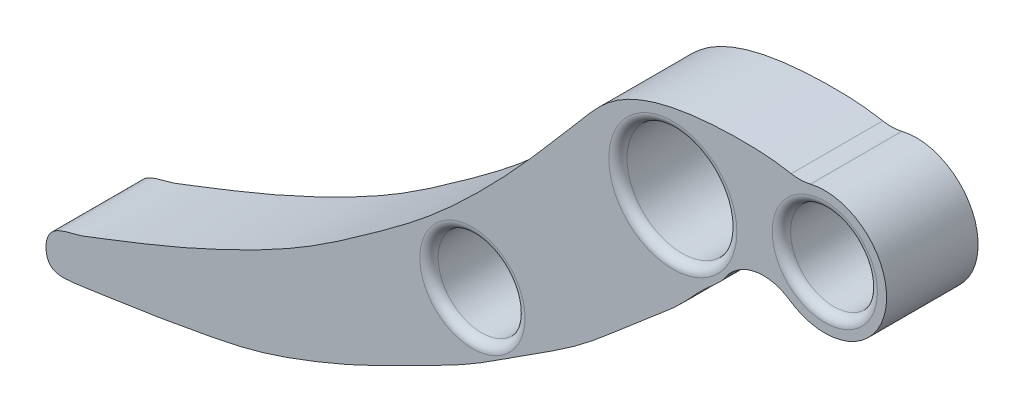
ISO-10303-21;
HEADER;
FILE_DESCRIPTION(('STEP AP214'),'2;1');
FILE_NAME('part.step','',(''),(''),'','','');
FILE_SCHEMA(('AUTOMOTIVE_DESIGN { 1 0 10303 214 1 1 1 1 }'));
ENDSEC;
DATA;
#1=APPLICATION_CONTEXT('core data for automotive mechanical design processes');
#2=APPLICATION_PROTOCOL_DEFINITION('international standard','automotive_design',2000,#1);
#3=PRODUCT_CONTEXT('',#1,'mechanical');
#4=PRODUCT('Part','Part','',(#3));
#5=PRODUCT_RELATED_PRODUCT_CATEGORY('part','',(#4));
#6=PRODUCT_DEFINITION_FORMATION('','',#4);
#7=PRODUCT_DEFINITION_CONTEXT('part definition',#1,'design');
#8=PRODUCT_DEFINITION('design','',#6,#7);
#9=PRODUCT_DEFINITION_SHAPE('','',#8);
#10=(LENGTH_UNIT() NAMED_UNIT(*) SI_UNIT(.MILLI.,.METRE.));
#11=(NAMED_UNIT(*) PLANE_ANGLE_UNIT() SI_UNIT($,.RADIAN.));
#12=(NAMED_UNIT(*) SI_UNIT($,.STERADIAN.) SOLID_ANGLE_UNIT());
#13=UNCERTAINTY_MEASURE_WITH_UNIT(LENGTH_MEASURE(1.E-05),#10,'distance_accuracy_value','');
#14=(GEOMETRIC_REPRESENTATION_CONTEXT(3) GLOBAL_UNCERTAINTY_ASSIGNED_CONTEXT((#13)) GLOBAL_UNIT_ASSIGNED_CONTEXT((#10,
#11,#12)) REPRESENTATION_CONTEXT('',''));
#15=CARTESIAN_POINT('',(0.,0.,0.));
#16=DIRECTION('',(0.,0.,1.));
#17=DIRECTION('',(1.,0.,0.));
#18=AXIS2_PLACEMENT_3D('',#15,#16,#17);
#19=CARTESIAN_POINT('',(14.8906172336241,5.13952335697984,4.));
#20=CARTESIAN_POINT('',(11.8147997997312,6.98265296999133,4.));
#21=CARTESIAN_POINT('',(6.97061773138313,7.34913695348203,4.));
#22=CARTESIAN_POINT('',(0.0255067181909356,6.82829789173735,4.));
#23=CARTESIAN_POINT('',(-4.91113051022182,5.37360829612983,4.));
#24=CARTESIAN_POINT('',(-8.00179722143057,1.72142887729755,4.));
#25=CARTESIAN_POINT('',(-10.6771431186925,-1.44866581411064,4.));
#26=CARTESIAN_POINT('',(-13.6194497429282,-4.80712519572691,4.));
#27=CARTESIAN_POINT('',(-17.4437385651632,-8.79751193254247,4.));
#28=CARTESIAN_POINT('',(-21.5414716082317,-12.5724179526008,4.));
#29=CARTESIAN_POINT('',(-26.6115682871123,-16.2824321569651,4.));
#30=CARTESIAN_POINT('',(-31.7679818192911,-19.9143573813329,4.));
#31=CARTESIAN_POINT('',(-37.8743258746726,-23.1648730949254,4.));
#32=CARTESIAN_POINT('',(-44.290018540295,-26.081814499858,4.));
#33=CARTESIAN_POINT('',(-48.7035337551994,-27.7570490931934,4.));
#34=CARTESIAN_POINT('',(-52.4560401220076,-29.2525018396844,4.));
#35=CARTESIAN_POINT('',(-54.8950665794195,-29.458745870946,4.));
#36=CARTESIAN_POINT('',(-54.8752929321307,-33.1891540703935,4.));
#37=CARTESIAN_POINT('',(-50.8297040981423,-32.605168512718,4.));
#38=CARTESIAN_POINT('',(-45.8082015178911,-31.8917719175334,4.));
#39=CARTESIAN_POINT('',(-41.8530072288273,-31.1890679821412,4.));
#40=CARTESIAN_POINT('',(-36.8359921070759,-30.2305680535858,4.));
#41=CARTESIAN_POINT('',(-32.3334348450041,-28.6931763162461,4.));
#42=CARTESIAN_POINT('',(-27.5209531029798,-26.7119670644439,4.));
#43=CARTESIAN_POINT('',(-22.5920905661132,-24.1756126445635,4.));
#44=CARTESIAN_POINT('',(-17.7022474939589,-21.7780258061123,4.));
#45=CARTESIAN_POINT('',(-12.9767858292529,-18.57152719076,4.));
#46=CARTESIAN_POINT('',(-8.50635045017944,-15.8496570433512,4.));
#47=CARTESIAN_POINT('',(-4.79444683234737,-12.6489598924876,4.));
#48=CARTESIAN_POINT('',(-1.92195812157698,-10.1724124225189,4.));
#49=CARTESIAN_POINT('',(0.774409867975847,-7.95562213565333,4.));
#50=CARTESIAN_POINT('',(2.53720201195287,-5.8137401298697,4.));
#51=CARTESIAN_POINT('',(4.61350821998148,-4.22409829569652,4.));
#52=CARTESIAN_POINT('',(5.39053229105744,-2.38509376200141,4.));
#53=CARTESIAN_POINT('',(7.90182410880479,-0.999504146319266,4.));
#54=CARTESIAN_POINT('',(10.079853046453,-1.20270173484881,4.));
#55=CARTESIAN_POINT('',(11.4905990521554,-1.84225935748622,4.));
#56=B_SPLINE_CURVE_WITH_KNOTS('',3,(#19,#20,#21,#22,#23,#24,#25,#26,#27,#28,#29,#30,#31,#32,#33,
#34,#35,#36,#37,#38,#39,#40,#41,#42,#43,#44,#45,#46,#47,#48,#49,#50,#51,#52,#53,#54,#55),
.UNSPECIFIED.,.F.,.F.,(4,1,1,1,1,1,1,1,1,1,1,1,1,1,1,1,1,1,1,1,1,1,1,1,1,1,1,1,1,1,1,1,1,1,4),
(0.,0.0649005022991945,0.0884003629295933,0.131422169041814,0.155558546016789,0.176507872680281,
0.209387060788076,0.239014532561419,0.280012714709477,0.313443891551223,0.356616380608806,
0.397784948745958,0.443365378941093,0.485923752332835,0.492844268612064,0.512570541733386,
0.525807518463163,0.542884707508247,0.574177107133922,0.610427481034306,0.636920676772048,
0.666470325120271,0.70094601674211,0.734598708994912,0.771031932891885,0.8033765924054,
0.842135532903864,0.869451651947628,0.895551683692015,0.913715434169222,0.93505941780996,
0.947634120889373,0.962394457054,0.970576348482298,1.),.UNSPECIFIED.);
#57=DIRECTION('',(0.,0.,-1.));
#58=VECTOR('',#57,1.);
#59=SURFACE_OF_LINEAR_EXTRUSION('',#56,#58);
#60=CARTESIAN_POINT('',(10.354654534001,6.80738077680452,4.));
#61=VERTEX_POINT('',#60);
#62=CARTESIAN_POINT('',(4.63153611186355,-3.86941888906301,4.));
#63=VERTEX_POINT('',#62);
#64=EDGE_CURVE('E96',#61,#63,#56,.T.);
#65=ORIENTED_EDGE('',*,*,#64,.F.);
#66=DIRECTION('',(0.,0.,-1.));
#67=VECTOR('',#66,1.);
#68=CARTESIAN_POINT('',(10.354654534001,6.80738077680452,4.));
#69=LINE('',#68,#67);
#70=CARTESIAN_POINT('',(10.354654534001,6.80738077680452,-4.));
#71=VERTEX_POINT('',#70);
#72=EDGE_CURVE('E109',#61,#71,#69,.T.);
#73=ORIENTED_EDGE('',*,*,#72,.T.);
#74=CARTESIAN_POINT('',(14.8906172336241,5.13952335697984,-4.));
#75=CARTESIAN_POINT('',(11.8147997997312,6.98265296999133,-4.));
#76=CARTESIAN_POINT('',(6.97061773138313,7.34913695348203,-4.));
#77=CARTESIAN_POINT('',(0.0255067181909356,6.82829789173735,-4.));
#78=CARTESIAN_POINT('',(-4.91113051022182,5.37360829612983,-4.));
#79=CARTESIAN_POINT('',(-8.00179722143057,1.72142887729755,-4.));
#80=CARTESIAN_POINT('',(-10.6771431186925,-1.44866581411064,-4.));
#81=CARTESIAN_POINT('',(-13.6194497429282,-4.80712519572691,-4.));
#82=CARTESIAN_POINT('',(-17.4437385651632,-8.79751193254247,-4.));
#83=CARTESIAN_POINT('',(-21.5414716082317,-12.5724179526008,-4.));
#84=CARTESIAN_POINT('',(-26.6115682871123,-16.2824321569651,-4.));
#85=CARTESIAN_POINT('',(-31.7679818192911,-19.9143573813329,-4.));
#86=CARTESIAN_POINT('',(-37.8743258746726,-23.1648730949254,-4.));
#87=CARTESIAN_POINT('',(-44.290018540295,-26.081814499858,-4.));
#88=CARTESIAN_POINT('',(-48.7035337551994,-27.7570490931934,-4.));
#89=CARTESIAN_POINT('',(-52.4560401220076,-29.2525018396844,-4.));
#90=CARTESIAN_POINT('',(-54.8950665794195,-29.458745870946,-4.));
#91=CARTESIAN_POINT('',(-54.8752929321307,-33.1891540703935,-4.));
#92=CARTESIAN_POINT('',(-50.8297040981423,-32.605168512718,-4.));
#93=CARTESIAN_POINT('',(-45.8082015178911,-31.8917719175334,-4.));
#94=CARTESIAN_POINT('',(-41.8530072288273,-31.1890679821412,-4.));
#95=CARTESIAN_POINT('',(-36.8359921070759,-30.2305680535858,-4.));
#96=CARTESIAN_POINT('',(-32.3334348450041,-28.6931763162461,-4.));
#97=CARTESIAN_POINT('',(-27.5209531029798,-26.7119670644439,-4.));
#98=CARTESIAN_POINT('',(-22.5920905661132,-24.1756126445635,-4.));
#99=CARTESIAN_POINT('',(-17.7022474939589,-21.7780258061123,-4.));
#100=CARTESIAN_POINT('',(-12.9767858292529,-18.57152719076,-4.));
#101=CARTESIAN_POINT('',(-8.50635045017944,-15.8496570433512,-4.));
#102=CARTESIAN_POINT('',(-4.79444683234737,-12.6489598924876,-4.));
#103=CARTESIAN_POINT('',(-1.92195812157698,-10.1724124225189,-4.));
#104=CARTESIAN_POINT('',(0.774409867975847,-7.95562213565333,-4.));
#105=CARTESIAN_POINT('',(2.53720201195287,-5.8137401298697,-4.));
#106=CARTESIAN_POINT('',(4.61350821998148,-4.22409829569652,-4.));
#107=CARTESIAN_POINT('',(5.39053229105744,-2.38509376200141,-4.));
#108=CARTESIAN_POINT('',(7.90182410880479,-0.999504146319266,-4.));
#109=CARTESIAN_POINT('',(10.079853046453,-1.20270173484881,-4.));
#110=CARTESIAN_POINT('',(11.4905990521554,-1.84225935748622,-4.));
#111=B_SPLINE_CURVE_WITH_KNOTS('',3,(#74,#75,#76,#77,#78,#79,#80,#81,#82,#83,#84,#85,#86,#87,
#88,#89,#90,#91,#92,#93,#94,#95,#96,#97,#98,#99,#100,#101,#102,#103,#104,#105,#106,#107,#108,
#109,#110),.UNSPECIFIED.,.F.,.F.,(4,1,1,1,1,1,1,1,1,1,1,1,1,1,1,1,1,1,1,1,1,1,1,1,1,1,1,1,1,1,1,
1,1,1,4),(0.,0.0649005022991945,0.0884003629295933,0.131422169041814,0.155558546016789,
0.176507872680281,0.209387060788076,0.239014532561419,0.280012714709477,0.313443891551223,
0.356616380608806,0.397784948745958,0.443365378941093,0.485923752332835,0.492844268612064,
0.512570541733386,0.525807518463163,0.542884707508247,0.574177107133922,0.610427481034306,
0.636920676772048,0.666470325120271,0.70094601674211,0.734598708994912,0.771031932891885,
0.8033765924054,0.842135532903864,0.869451651947628,0.895551683692015,0.913715434169222,
0.93505941780996,0.947634120889373,0.962394457054,0.970576348482298,1.),.UNSPECIFIED.);
#112=CARTESIAN_POINT('',(4.63153611186355,-3.86941888906301,-4.));
#113=VERTEX_POINT('',#112);
#114=EDGE_CURVE('E97',#71,#113,#111,.T.);
#115=ORIENTED_EDGE('',*,*,#114,.T.);
#116=DIRECTION('',(0.,0.,-1.));
#117=VECTOR('',#116,1.);
#118=CARTESIAN_POINT('',(4.63153611186355,-3.86941888906301,-4.));
#119=LINE('',#118,#117);
#120=EDGE_CURVE('E88',#113,#63,#119,.F.);
#121=ORIENTED_EDGE('',*,*,#120,.T.);
#122=EDGE_LOOP('',(#65,#73,#115,#121));
#123=FACE_BOUND('',#122,.T.);
#124=ADVANCED_FACE('F38',(#123),#59,.F.);
#125=CARTESIAN_POINT('',(13.2914162094649,1.59954005959176,4.));
#126=DIRECTION('',(0.,0.,-1.));
#127=DIRECTION('',(-1.,0.,0.));
#128=AXIS2_PLACEMENT_3D('',#125,#126,#127);
#129=CYLINDRICAL_SURFACE('',#128,5.4);
#130=CARTESIAN_POINT('',(13.2914162094649,1.59954005959176,-4.));
#131=DIRECTION('',(0.,0.,1.));
#132=DIRECTION('',(1.,0.,0.));
#133=AXIS2_PLACEMENT_3D('',#130,#131,#132);
#134=CIRCLE('',#133,5.4);
#135=CARTESIAN_POINT('',(10.2142904399725,-2.83794763038843,-4.));
#136=VERTEX_POINT('',#135);
#137=CARTESIAN_POINT('',(12.0282240750873,6.84971583109186,-4.));
#138=VERTEX_POINT('',#137);
#139=EDGE_CURVE('E92',#136,#138,#134,.T.);
#140=ORIENTED_EDGE('',*,*,#139,.T.);
#141=DIRECTION('',(0.,0.,-1.));
#142=VECTOR('',#141,1.);
#143=CARTESIAN_POINT('',(12.0282240750873,6.84971583109186,4.));
#144=LINE('',#143,#142);
#145=CARTESIAN_POINT('',(12.0282240750873,6.84971583109186,4.));
#146=VERTEX_POINT('',#145);
#147=EDGE_CURVE('E60',#138,#146,#144,.F.);
#148=ORIENTED_EDGE('',*,*,#147,.T.);
#149=CARTESIAN_POINT('',(13.2914162094649,1.59954005959176,4.));
#150=DIRECTION('',(0.,0.,1.));
#151=DIRECTION('',(1.,0.,0.));
#152=AXIS2_PLACEMENT_3D('',#149,#150,#151);
#153=CIRCLE('',#152,5.4);
#154=CARTESIAN_POINT('',(10.2142904399725,-2.83794763038843,4.));
#155=VERTEX_POINT('',#154);
#156=EDGE_CURVE('E93',#155,#146,#153,.T.);
#157=ORIENTED_EDGE('',*,*,#156,.F.);
#158=DIRECTION('',(0.,0.,-1.));
#159=VECTOR('',#158,1.);
#160=CARTESIAN_POINT('',(10.2142904399725,-2.83794763038843,4.));
#161=LINE('',#160,#159);
#162=EDGE_CURVE('E86',#155,#136,#161,.T.);
#163=ORIENTED_EDGE('',*,*,#162,.T.);
#164=EDGE_LOOP('',(#140,#148,#157,#163));
#165=FACE_BOUND('',#164,.T.);
#166=ADVANCED_FACE('F91',(#165),#129,.T.);
#167=CARTESIAN_POINT('',(-17.5147030632143,-15.7755164672443,4.));
#168=DIRECTION('',(0.,0.,-1.));
#169=DIRECTION('',(-1.,0.,0.));
#170=AXIS2_PLACEMENT_3D('',#167,#168,#169);
#171=CYLINDRICAL_SURFACE('',#170,3.8);
#172=CARTESIAN_POINT('',(-17.5147030632143,-15.7755164672443,-3.2));
#173=DIRECTION('',(0.,0.,1.));
#174=DIRECTION('',(1.,0.,0.));
#175=AXIS2_PLACEMENT_3D('',#172,#173,#174);
#176=CIRCLE('',#175,3.8);
#177=CARTESIAN_POINT('',(-13.7147030632143,-15.7755164672443,-3.2));
#178=VERTEX_POINT('',#177);
#179=EDGE_CURVE('E128',#178,#178,#176,.F.);
#180=ORIENTED_EDGE('',*,*,#179,.T.);
#181=EDGE_LOOP('',(#180));
#182=FACE_BOUND('',#181,.T.);
#183=CARTESIAN_POINT('',(-17.5147030632143,-15.7755164672443,3.2));
#184=DIRECTION('',(0.,0.,1.));
#185=DIRECTION('',(1.,0.,0.));
#186=AXIS2_PLACEMENT_3D('',#183,#184,#185);
#187=CIRCLE('',#186,3.8);
#188=CARTESIAN_POINT('',(-13.7147030632143,-15.7755164672443,3.2));
#189=VERTEX_POINT('',#188);
#190=EDGE_CURVE('E125',#189,#189,#187,.T.);
#191=ORIENTED_EDGE('',*,*,#190,.T.);
#192=EDGE_LOOP('',(#191));
#193=FACE_BOUND('',#192,.T.);
#194=ADVANCED_FACE('F165',(#182,#193),#171,.F.);
#195=CARTESIAN_POINT('',(0.,0.,4.));
#196=DIRECTION('',(0.,0.,-1.));
#197=DIRECTION('',(-1.,0.,0.));
#198=AXIS2_PLACEMENT_3D('',#195,#196,#197);
#199=CYLINDRICAL_SURFACE('',#198,4.8);
#200=CARTESIAN_POINT('',(0.,0.,-3.2));
#201=DIRECTION('',(0.,0.,1.));
#202=DIRECTION('',(1.,0.,0.));
#203=AXIS2_PLACEMENT_3D('',#200,#201,#202);
#204=CIRCLE('',#203,4.8);
#205=CARTESIAN_POINT('',(4.8,0.,-3.2));
#206=VERTEX_POINT('',#205);
#207=EDGE_CURVE('E143',#206,#206,#204,.F.);
#208=ORIENTED_EDGE('',*,*,#207,.T.);
#209=EDGE_LOOP('',(#208));
#210=FACE_BOUND('',#209,.T.);
#211=CARTESIAN_POINT('',(0.,0.,3.2));
#212=DIRECTION('',(0.,0.,1.));
#213=DIRECTION('',(1.,0.,0.));
#214=AXIS2_PLACEMENT_3D('',#211,#212,#213);
#215=CIRCLE('',#214,4.8);
#216=CARTESIAN_POINT('',(4.8,0.,3.2));
#217=VERTEX_POINT('',#216);
#218=EDGE_CURVE('E140',#217,#217,#215,.T.);
#219=ORIENTED_EDGE('',*,*,#218,.T.);
#220=EDGE_LOOP('',(#219));
#221=FACE_BOUND('',#220,.T.);
#222=ADVANCED_FACE('F210',(#210,#221),#199,.F.);
#223=CARTESIAN_POINT('',(13.2914162094649,1.59954005959176,4.));
#224=DIRECTION('',(0.,0.,-1.));
#225=DIRECTION('',(-1.,0.,0.));
#226=AXIS2_PLACEMENT_3D('',#223,#224,#225);
#227=CYLINDRICAL_SURFACE('',#226,3.8);
#228=CARTESIAN_POINT('',(13.2914162094649,1.59954005959176,-3.2));
#229=DIRECTION('',(0.,0.,1.));
#230=DIRECTION('',(1.,0.,0.));
#231=AXIS2_PLACEMENT_3D('',#228,#229,#230);
#232=CIRCLE('',#231,3.8);
#233=CARTESIAN_POINT('',(17.0914162094649,1.59954005959176,-3.2));
#234=VERTEX_POINT('',#233);
#235=EDGE_CURVE('E11',#234,#234,#232,.F.);
#236=ORIENTED_EDGE('',*,*,#235,.T.);
#237=EDGE_LOOP('',(#236));
#238=FACE_BOUND('',#237,.T.);
#239=CARTESIAN_POINT('',(13.2914162094649,1.59954005959176,3.2));
#240=DIRECTION('',(0.,0.,1.));
#241=DIRECTION('',(1.,0.,0.));
#242=AXIS2_PLACEMENT_3D('',#239,#240,#241);
#243=CIRCLE('',#242,3.8);
#244=CARTESIAN_POINT('',(17.0914162094649,1.59954005959176,3.2));
#245=VERTEX_POINT('',#244);
#246=EDGE_CURVE('E46',#245,#245,#243,.T.);
#247=ORIENTED_EDGE('',*,*,#246,.T.);
#248=EDGE_LOOP('',(#247));
#249=FACE_BOUND('',#248,.T.);
#250=ADVANCED_FACE('F148',(#238,#249),#227,.F.);
#251=CARTESIAN_POINT('',(0.,0.,4.));
#252=DIRECTION('',(0.,0.,1.));
#253=DIRECTION('',(1.,0.,0.));
#254=AXIS2_PLACEMENT_3D('',#251,#252,#253);
#255=PLANE('',#254);
#256=CARTESIAN_POINT('',(-17.5147030632143,-15.7755164672443,4.));
#257=DIRECTION('',(0.,0.,1.));
#258=DIRECTION('',(1.,0.,0.));
#259=AXIS2_PLACEMENT_3D('',#256,#257,#258);
#260=CIRCLE('',#259,4.6);
#261=CARTESIAN_POINT('',(-12.9147030632143,-15.7755164672443,4.));
#262=VERTEX_POINT('',#261);
#263=EDGE_CURVE('E137',#262,#262,#260,.F.);
#264=ORIENTED_EDGE('',*,*,#263,.T.);
#265=EDGE_LOOP('',(#264));
#266=FACE_BOUND('',#265,.T.);
#267=CARTESIAN_POINT('',(0.,0.,4.));
#268=DIRECTION('',(0.,0.,1.));
#269=DIRECTION('',(1.,0.,0.));
#270=AXIS2_PLACEMENT_3D('',#267,#268,#269);
#271=CIRCLE('',#270,5.6);
#272=CARTESIAN_POINT('',(5.6,0.,4.));
#273=VERTEX_POINT('',#272);
#274=EDGE_CURVE('E134',#273,#273,#271,.F.);
#275=ORIENTED_EDGE('',*,*,#274,.T.);
#276=EDGE_LOOP('',(#275));
#277=FACE_BOUND('',#276,.T.);
#278=CARTESIAN_POINT('',(13.2914162094649,1.59954005959176,4.));
#279=DIRECTION('',(0.,0.,1.));
#280=DIRECTION('',(1.,0.,0.));
#281=AXIS2_PLACEMENT_3D('',#278,#279,#280);
#282=CIRCLE('',#281,4.6);
#283=CARTESIAN_POINT('',(17.8914162094649,1.59954005959176,4.));
#284=VERTEX_POINT('',#283);
#285=EDGE_CURVE('E131',#284,#284,#282,.F.);
#286=ORIENTED_EDGE('',*,*,#285,.T.);
#287=EDGE_LOOP('',(#286));
#288=FACE_BOUND('',#287,.T.);
#289=ORIENTED_EDGE('',*,*,#156,.T.);
#290=CARTESIAN_POINT('',(11.0925261977706,10.7387349210919,4.));
#291=DIRECTION('',(0.,0.,1.));
#292=DIRECTION('',(1.,0.,0.));
#293=AXIS2_PLACEMENT_3D('',#290,#291,#292);
#294=CIRCLE('',#293,4.);
#295=EDGE_CURVE('E114',#146,#61,#294,.F.);
#296=ORIENTED_EDGE('',*,*,#295,.T.);
#297=ORIENTED_EDGE('',*,*,#64,.T.);
#298=CARTESIAN_POINT('',(7.93493801812621,-6.1249755488923,4.));
#299=DIRECTION('',(0.,0.,1.));
#300=DIRECTION('',(1.,0.,0.));
#301=AXIS2_PLACEMENT_3D('',#298,#299,#300);
#302=CIRCLE('',#301,4.);
#303=EDGE_CURVE('E89',#63,#155,#302,.F.);
#304=ORIENTED_EDGE('',*,*,#303,.T.);
#305=EDGE_LOOP('',(#289,#296,#297,#304));
#306=FACE_BOUND('',#305,.T.);
#307=ADVANCED_FACE('F179',(#266,#277,#288,#306),#255,.T.);
#308=CARTESIAN_POINT('',(0.,0.,-4.));
#309=DIRECTION('',(0.,0.,1.));
#310=DIRECTION('',(1.,0.,0.));
#311=AXIS2_PLACEMENT_3D('',#308,#309,#310);
#312=PLANE('',#311);
#313=CARTESIAN_POINT('',(-17.5147030632143,-15.7755164672443,-4.));
#314=DIRECTION('',(0.,0.,1.));
#315=DIRECTION('',(1.,0.,0.));
#316=AXIS2_PLACEMENT_3D('',#313,#314,#315);
#317=CIRCLE('',#316,4.6);
#318=CARTESIAN_POINT('',(-12.9147030632143,-15.7755164672443,-4.));
#319=VERTEX_POINT('',#318);
#320=EDGE_CURVE('E122',#319,#319,#317,.T.);
#321=ORIENTED_EDGE('',*,*,#320,.T.);
#322=EDGE_LOOP('',(#321));
#323=FACE_BOUND('',#322,.T.);
#324=CARTESIAN_POINT('',(0.,0.,-4.));
#325=DIRECTION('',(0.,0.,1.));
#326=DIRECTION('',(1.,0.,0.));
#327=AXIS2_PLACEMENT_3D('',#324,#325,#326);
#328=CIRCLE('',#327,5.6);
#329=CARTESIAN_POINT('',(5.6,0.,-4.));
#330=VERTEX_POINT('',#329);
#331=EDGE_CURVE('E119',#330,#330,#328,.T.);
#332=ORIENTED_EDGE('',*,*,#331,.T.);
#333=EDGE_LOOP('',(#332));
#334=FACE_BOUND('',#333,.T.);
#335=CARTESIAN_POINT('',(13.2914162094649,1.59954005959176,-4.));
#336=DIRECTION('',(0.,0.,1.));
#337=DIRECTION('',(1.,0.,0.));
#338=AXIS2_PLACEMENT_3D('',#335,#336,#337);
#339=CIRCLE('',#338,4.6);
#340=CARTESIAN_POINT('',(17.8914162094649,1.59954005959176,-4.));
#341=VERTEX_POINT('',#340);
#342=EDGE_CURVE('E116',#341,#341,#339,.T.);
#343=ORIENTED_EDGE('',*,*,#342,.T.);
#344=EDGE_LOOP('',(#343));
#345=FACE_BOUND('',#344,.T.);
#346=ORIENTED_EDGE('',*,*,#114,.F.);
#347=CARTESIAN_POINT('',(11.0925261977706,10.7387349210919,-4.));
#348=DIRECTION('',(0.,0.,1.));
#349=DIRECTION('',(1.,0.,0.));
#350=AXIS2_PLACEMENT_3D('',#347,#348,#349);
#351=CIRCLE('',#350,4.);
#352=EDGE_CURVE('E53',#71,#138,#351,.T.);
#353=ORIENTED_EDGE('',*,*,#352,.T.);
#354=ORIENTED_EDGE('',*,*,#139,.F.);
#355=CARTESIAN_POINT('',(7.93493801812621,-6.1249755488923,-4.));
#356=DIRECTION('',(0.,0.,1.));
#357=DIRECTION('',(1.,0.,0.));
#358=AXIS2_PLACEMENT_3D('',#355,#356,#357);
#359=CIRCLE('',#358,4.);
#360=EDGE_CURVE('E82',#136,#113,#359,.T.);
#361=ORIENTED_EDGE('',*,*,#360,.T.);
#362=EDGE_LOOP('',(#346,#353,#354,#361));
#363=FACE_BOUND('',#362,.T.);
#364=ADVANCED_FACE('F95',(#323,#334,#345,#363),#312,.F.);
#365=CARTESIAN_POINT('',(7.93493801812621,-6.1249755488923,0.));
#366=DIRECTION('',(0.,0.,-1.));
#367=DIRECTION('',(-1.,0.,0.));
#368=AXIS2_PLACEMENT_3D('',#365,#366,#367);
#369=CYLINDRICAL_SURFACE('',#368,4.);
#370=ORIENTED_EDGE('',*,*,#303,.F.);
#371=ORIENTED_EDGE('',*,*,#120,.F.);
#372=ORIENTED_EDGE('',*,*,#360,.F.);
#373=ORIENTED_EDGE('',*,*,#162,.F.);
#374=EDGE_LOOP('',(#370,#371,#372,#373));
#375=FACE_BOUND('',#374,.T.);
#376=ADVANCED_FACE('F85',(#375),#369,.F.);
#377=CARTESIAN_POINT('',(11.0925261977706,10.7387349210919,0.));
#378=DIRECTION('',(0.,0.,-1.));
#379=DIRECTION('',(-1.,0.,0.));
#380=AXIS2_PLACEMENT_3D('',#377,#378,#379);
#381=CYLINDRICAL_SURFACE('',#380,4.);
#382=ORIENTED_EDGE('',*,*,#295,.F.);
#383=ORIENTED_EDGE('',*,*,#147,.F.);
#384=ORIENTED_EDGE('',*,*,#352,.F.);
#385=ORIENTED_EDGE('',*,*,#72,.F.);
#386=EDGE_LOOP('',(#382,#383,#384,#385));
#387=FACE_BOUND('',#386,.T.);
#388=ADVANCED_FACE('F182',(#387),#381,.F.);
#389=CARTESIAN_POINT('',(-17.5147030632143,-15.7755164672443,-3.2));
#390=DIRECTION('',(0.,0.,1.));
#391=DIRECTION('',(1.,0.,0.));
#392=AXIS2_PLACEMENT_3D('',#389,#390,#391);
#393=TOROIDAL_SURFACE('',#392,4.6,0.8);
#394=ORIENTED_EDGE('',*,*,#179,.F.);
#395=EDGE_LOOP('',(#394));
#396=FACE_BOUND('',#395,.T.);
#397=ORIENTED_EDGE('',*,*,#320,.F.);
#398=EDGE_LOOP('',(#397));
#399=FACE_BOUND('',#398,.T.);
#400=ADVANCED_FACE('F184',(#396,#399),#393,.T.);
#401=CARTESIAN_POINT('',(-17.5147030632143,-15.7755164672443,3.2));
#402=DIRECTION('',(0.,0.,1.));
#403=DIRECTION('',(1.,0.,0.));
#404=AXIS2_PLACEMENT_3D('',#401,#402,#403);
#405=TOROIDAL_SURFACE('',#404,4.6,0.8);
#406=ORIENTED_EDGE('',*,*,#263,.F.);
#407=EDGE_LOOP('',(#406));
#408=FACE_BOUND('',#407,.T.);
#409=ORIENTED_EDGE('',*,*,#190,.F.);
#410=EDGE_LOOP('',(#409));
#411=FACE_BOUND('',#410,.T.);
#412=ADVANCED_FACE('F190',(#408,#411),#405,.T.);
#413=CARTESIAN_POINT('',(0.,0.,-3.2));
#414=DIRECTION('',(0.,0.,1.));
#415=DIRECTION('',(1.,0.,0.));
#416=AXIS2_PLACEMENT_3D('',#413,#414,#415);
#417=TOROIDAL_SURFACE('',#416,5.6,0.8);
#418=ORIENTED_EDGE('',*,*,#207,.F.);
#419=EDGE_LOOP('',(#418));
#420=FACE_BOUND('',#419,.T.);
#421=ORIENTED_EDGE('',*,*,#331,.F.);
#422=EDGE_LOOP('',(#421));
#423=FACE_BOUND('',#422,.T.);
#424=ADVANCED_FACE('F197',(#420,#423),#417,.T.);
#425=CARTESIAN_POINT('',(0.,0.,3.2));
#426=DIRECTION('',(0.,0.,1.));
#427=DIRECTION('',(1.,0.,0.));
#428=AXIS2_PLACEMENT_3D('',#425,#426,#427);
#429=TOROIDAL_SURFACE('',#428,5.6,0.8);
#430=ORIENTED_EDGE('',*,*,#274,.F.);
#431=EDGE_LOOP('',(#430));
#432=FACE_BOUND('',#431,.T.);
#433=ORIENTED_EDGE('',*,*,#218,.F.);
#434=EDGE_LOOP('',(#433));
#435=FACE_BOUND('',#434,.T.);
#436=ADVANCED_FACE('F156',(#432,#435),#429,.T.);
#437=CARTESIAN_POINT('',(13.2914162094649,1.59954005959176,-3.2));
#438=DIRECTION('',(0.,0.,1.));
#439=DIRECTION('',(1.,0.,0.));
#440=AXIS2_PLACEMENT_3D('',#437,#438,#439);
#441=TOROIDAL_SURFACE('',#440,4.6,0.8);
#442=ORIENTED_EDGE('',*,*,#235,.F.);
#443=EDGE_LOOP('',(#442));
#444=FACE_BOUND('',#443,.T.);
#445=ORIENTED_EDGE('',*,*,#342,.F.);
#446=EDGE_LOOP('',(#445));
#447=FACE_BOUND('',#446,.T.);
#448=ADVANCED_FACE('F151',(#444,#447),#441,.T.);
#449=CARTESIAN_POINT('',(13.2914162094649,1.59954005959176,3.2));
#450=DIRECTION('',(0.,0.,1.));
#451=DIRECTION('',(1.,0.,0.));
#452=AXIS2_PLACEMENT_3D('',#449,#450,#451);
#453=TOROIDAL_SURFACE('',#452,4.6,0.8);
#454=ORIENTED_EDGE('',*,*,#285,.F.);
#455=EDGE_LOOP('',(#454));
#456=FACE_BOUND('',#455,.T.);
#457=ORIENTED_EDGE('',*,*,#246,.F.);
#458=EDGE_LOOP('',(#457));
#459=FACE_BOUND('',#458,.T.);
#460=ADVANCED_FACE('F40',(#456,#459),#453,.T.);
#461=CLOSED_SHELL('',(#124,#166,#194,#222,#250,#307,#364,#376,#388,#400,#412,#424,#436,#448,#460));
#462=MANIFOLD_SOLID_BREP('B2',#461);
#463=ADVANCED_BREP_SHAPE_REPRESENTATION('',(#18,#462),#14);
#464=SHAPE_DEFINITION_REPRESENTATION(#9,#463);
ENDSEC;
END-ISO-10303-21;
